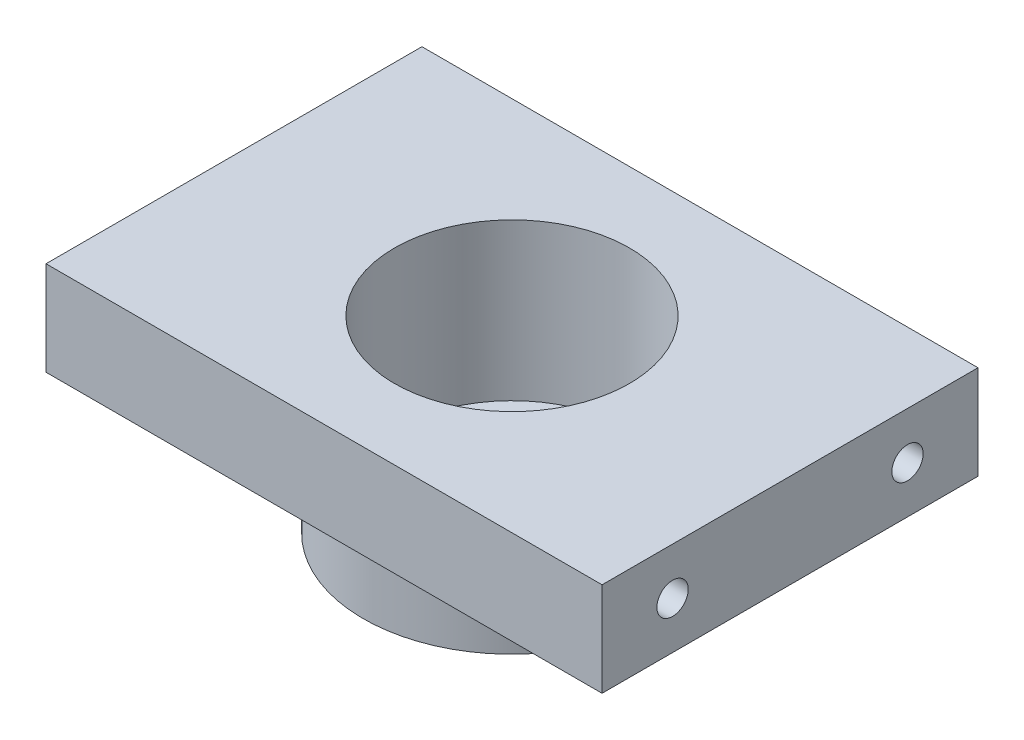
ISO-10303-21;
HEADER;
FILE_DESCRIPTION(('STEP AP214'),'2;1');
FILE_NAME('part.step','',(''),(''),'','','');
FILE_SCHEMA(('AUTOMOTIVE_DESIGN { 1 0 10303 214 1 1 1 1 }'));
ENDSEC;
DATA;
#1=APPLICATION_CONTEXT('core data for automotive mechanical design processes');
#2=APPLICATION_PROTOCOL_DEFINITION('international standard','automotive_design',2000,#1);
#3=PRODUCT_CONTEXT('',#1,'mechanical');
#4=PRODUCT('Part','Part','',(#3));
#5=PRODUCT_RELATED_PRODUCT_CATEGORY('part','',(#4));
#6=PRODUCT_DEFINITION_FORMATION('','',#4);
#7=PRODUCT_DEFINITION_CONTEXT('part definition',#1,'design');
#8=PRODUCT_DEFINITION('design','',#6,#7);
#9=PRODUCT_DEFINITION_SHAPE('','',#8);
#10=(LENGTH_UNIT() NAMED_UNIT(*) SI_UNIT(.MILLI.,.METRE.));
#11=(NAMED_UNIT(*) PLANE_ANGLE_UNIT() SI_UNIT($,.RADIAN.));
#12=(NAMED_UNIT(*) SI_UNIT($,.STERADIAN.) SOLID_ANGLE_UNIT());
#13=UNCERTAINTY_MEASURE_WITH_UNIT(LENGTH_MEASURE(1.E-05),#10,'distance_accuracy_value','');
#14=(GEOMETRIC_REPRESENTATION_CONTEXT(3) GLOBAL_UNCERTAINTY_ASSIGNED_CONTEXT((#13)) GLOBAL_UNIT_ASSIGNED_CONTEXT((#10,
#11,#12)) REPRESENTATION_CONTEXT('',''));
#15=CARTESIAN_POINT('',(0.,0.,0.));
#16=DIRECTION('',(0.,0.,1.));
#17=DIRECTION('',(1.,0.,0.));
#18=AXIS2_PLACEMENT_3D('',#15,#16,#17);
#19=CARTESIAN_POINT('',(59.,0.,0.));
#20=DIRECTION('',(0.,-1.,0.));
#21=DIRECTION('',(1.,0.,0.));
#22=AXIS2_PLACEMENT_3D('',#19,#20,#21);
#23=PLANE('',#22);
#24=CARTESIAN_POINT('',(0.,0.,0.));
#25=DIRECTION('',(0.,1.,0.));
#26=DIRECTION('',(-1.,0.,0.));
#27=AXIS2_PLACEMENT_3D('',#24,#25,#26);
#28=CIRCLE('',#27,15.);
#29=CARTESIAN_POINT('',(-15.,0.,0.));
#30=VERTEX_POINT('',#29);
#31=EDGE_CURVE('E123',#30,#30,#28,.T.);
#32=ORIENTED_EDGE('',*,*,#31,.F.);
#33=EDGE_LOOP('',(#32));
#34=FACE_BOUND('',#33,.T.);
#35=DIRECTION('',(1.,0.,0.));
#36=VECTOR('',#35,1.);
#37=CARTESIAN_POINT('',(35.5,0.,-24.));
#38=LINE('',#37,#36);
#39=CARTESIAN_POINT('',(-35.5000000000001,0.,-24.));
#40=VERTEX_POINT('',#39);
#41=CARTESIAN_POINT('',(35.5,0.,-24.));
#42=VERTEX_POINT('',#41);
#43=EDGE_CURVE('E48',#40,#42,#38,.T.);
#44=ORIENTED_EDGE('',*,*,#43,.F.);
#45=DIRECTION('',(0.,0.,-1.));
#46=VECTOR('',#45,1.);
#47=CARTESIAN_POINT('',(-35.5000000000001,0.,-24.));
#48=LINE('',#47,#46);
#49=CARTESIAN_POINT('',(-35.5000000000001,0.,24.));
#50=VERTEX_POINT('',#49);
#51=EDGE_CURVE('E78',#50,#40,#48,.T.);
#52=ORIENTED_EDGE('',*,*,#51,.F.);
#53=DIRECTION('',(-1.,0.,0.));
#54=VECTOR('',#53,1.);
#55=CARTESIAN_POINT('',(35.5,0.,24.));
#56=LINE('',#55,#54);
#57=CARTESIAN_POINT('',(35.5,0.,24.));
#58=VERTEX_POINT('',#57);
#59=EDGE_CURVE('E85',#58,#50,#56,.T.);
#60=ORIENTED_EDGE('',*,*,#59,.F.);
#61=DIRECTION('',(0.,0.,1.));
#62=VECTOR('',#61,1.);
#63=CARTESIAN_POINT('',(35.5,0.,-24.));
#64=LINE('',#63,#62);
#65=EDGE_CURVE('E90',#42,#58,#64,.T.);
#66=ORIENTED_EDGE('',*,*,#65,.F.);
#67=EDGE_LOOP('',(#44,#52,#60,#66));
#68=FACE_BOUND('',#67,.T.);
#69=ADVANCED_FACE('F32',(#34,#68),#23,.F.);
#70=CARTESIAN_POINT('',(19.,-12.,0.));
#71=DIRECTION('',(0.,1.,0.));
#72=DIRECTION('',(-1.,0.,0.));
#73=AXIS2_PLACEMENT_3D('',#70,#71,#72);
#74=PLANE('',#73);
#75=CARTESIAN_POINT('',(0.,-12.,0.));
#76=DIRECTION('',(0.,1.,0.));
#77=DIRECTION('',(-1.,0.,0.));
#78=AXIS2_PLACEMENT_3D('',#75,#76,#77);
#79=CIRCLE('',#78,19.);
#80=CARTESIAN_POINT('',(-19.,-12.,0.));
#81=VERTEX_POINT('',#80);
#82=EDGE_CURVE('E12',#81,#81,#79,.T.);
#83=ORIENTED_EDGE('',*,*,#82,.T.);
#84=EDGE_LOOP('',(#83));
#85=FACE_BOUND('',#84,.T.);
#86=DIRECTION('',(1.,0.,0.));
#87=VECTOR('',#86,1.);
#88=CARTESIAN_POINT('',(35.5,-12.,-24.));
#89=LINE('',#88,#87);
#90=CARTESIAN_POINT('',(-35.5000000000001,-12.,-24.));
#91=VERTEX_POINT('',#90);
#92=CARTESIAN_POINT('',(35.5,-12.,-24.));
#93=VERTEX_POINT('',#92);
#94=EDGE_CURVE('E97',#91,#93,#89,.T.);
#95=ORIENTED_EDGE('',*,*,#94,.T.);
#96=DIRECTION('',(0.,0.,1.));
#97=VECTOR('',#96,1.);
#98=CARTESIAN_POINT('',(35.5,-12.,-24.));
#99=LINE('',#98,#97);
#100=CARTESIAN_POINT('',(35.5,-12.,24.));
#101=VERTEX_POINT('',#100);
#102=EDGE_CURVE('E100',#93,#101,#99,.T.);
#103=ORIENTED_EDGE('',*,*,#102,.T.);
#104=DIRECTION('',(-1.,0.,0.));
#105=VECTOR('',#104,1.);
#106=CARTESIAN_POINT('',(35.5,-12.,24.));
#107=LINE('',#106,#105);
#108=CARTESIAN_POINT('',(-35.5000000000001,-12.,24.));
#109=VERTEX_POINT('',#108);
#110=EDGE_CURVE('E56',#101,#109,#107,.T.);
#111=ORIENTED_EDGE('',*,*,#110,.T.);
#112=DIRECTION('',(0.,0.,-1.));
#113=VECTOR('',#112,1.);
#114=CARTESIAN_POINT('',(-35.5000000000001,-12.,-24.));
#115=LINE('',#114,#113);
#116=EDGE_CURVE('E80',#109,#91,#115,.T.);
#117=ORIENTED_EDGE('',*,*,#116,.T.);
#118=EDGE_LOOP('',(#95,#103,#111,#117));
#119=FACE_BOUND('',#118,.T.);
#120=ADVANCED_FACE('F163',(#85,#119),#74,.F.);
#121=CARTESIAN_POINT('',(0.,0.,0.));
#122=DIRECTION('',(0.,1.,0.));
#123=DIRECTION('',(-1.,0.,0.));
#124=AXIS2_PLACEMENT_3D('',#121,#122,#123);
#125=CYLINDRICAL_SURFACE('',#124,19.);
#126=ORIENTED_EDGE('',*,*,#82,.F.);
#127=EDGE_LOOP('',(#126));
#128=FACE_BOUND('',#127,.T.);
#129=CARTESIAN_POINT('',(0.,-24.,0.));
#130=DIRECTION('',(0.,1.,0.));
#131=DIRECTION('',(-1.,0.,0.));
#132=AXIS2_PLACEMENT_3D('',#129,#130,#131);
#133=CIRCLE('',#132,19.);
#134=CARTESIAN_POINT('',(-19.,-24.,0.));
#135=VERTEX_POINT('',#134);
#136=EDGE_CURVE('E40',#135,#135,#133,.T.);
#137=ORIENTED_EDGE('',*,*,#136,.T.);
#138=EDGE_LOOP('',(#137));
#139=FACE_BOUND('',#138,.T.);
#140=ADVANCED_FACE('F168',(#128,#139),#125,.T.);
#141=CARTESIAN_POINT('',(9.,-24.,0.));
#142=DIRECTION('',(0.,1.,0.));
#143=DIRECTION('',(-1.,0.,0.));
#144=AXIS2_PLACEMENT_3D('',#141,#142,#143);
#145=PLANE('',#144);
#146=CARTESIAN_POINT('',(-12.9999999999998,-24.,-1.81557108488227E-13));
#147=DIRECTION('',(0.,-1.,0.));
#148=DIRECTION('',(1.,0.,0.));
#149=AXIS2_PLACEMENT_3D('',#146,#147,#148);
#150=CIRCLE('',#149,1.50000000000036);
#151=CARTESIAN_POINT('',(-11.4999999999995,-24.,-1.81557108488227E-13));
#152=VERTEX_POINT('',#151);
#153=EDGE_CURVE('E106',#152,#152,#150,.T.);
#154=ORIENTED_EDGE('',*,*,#153,.F.);
#155=EDGE_LOOP('',(#154));
#156=FACE_BOUND('',#155,.T.);
#157=CARTESIAN_POINT('',(2.7968506284591E-13,-24.,-12.9999999999999));
#158=DIRECTION('',(0.,-1.,0.));
#159=DIRECTION('',(1.,0.,0.));
#160=AXIS2_PLACEMENT_3D('',#157,#158,#159);
#161=CIRCLE('',#160,1.50000000000038);
#162=CARTESIAN_POINT('',(1.50000000000066,-24.,-12.9999999999999));
#163=VERTEX_POINT('',#162);
#164=EDGE_CURVE('E111',#163,#163,#161,.T.);
#165=ORIENTED_EDGE('',*,*,#164,.F.);
#166=EDGE_LOOP('',(#165));
#167=FACE_BOUND('',#166,.T.);
#168=CARTESIAN_POINT('',(13.,-24.,0.));
#169=DIRECTION('',(0.,-1.,0.));
#170=DIRECTION('',(1.,0.,0.));
#171=AXIS2_PLACEMENT_3D('',#168,#169,#170);
#172=CIRCLE('',#171,1.5);
#173=CARTESIAN_POINT('',(14.5,-24.,0.));
#174=VERTEX_POINT('',#173);
#175=EDGE_CURVE('E115',#174,#174,#172,.T.);
#176=ORIENTED_EDGE('',*,*,#175,.F.);
#177=EDGE_LOOP('',(#176));
#178=FACE_BOUND('',#177,.T.);
#179=CARTESIAN_POINT('',(0.,-24.,13.));
#180=DIRECTION('',(0.,-1.,0.));
#181=DIRECTION('',(1.,0.,0.));
#182=AXIS2_PLACEMENT_3D('',#179,#180,#181);
#183=CIRCLE('',#182,1.5);
#184=CARTESIAN_POINT('',(1.5,-24.,13.));
#185=VERTEX_POINT('',#184);
#186=EDGE_CURVE('E119',#185,#185,#183,.T.);
#187=ORIENTED_EDGE('',*,*,#186,.F.);
#188=EDGE_LOOP('',(#187));
#189=FACE_BOUND('',#188,.T.);
#190=ORIENTED_EDGE('',*,*,#136,.F.);
#191=EDGE_LOOP('',(#190));
#192=FACE_BOUND('',#191,.T.);
#193=CARTESIAN_POINT('',(0.,-24.,0.));
#194=DIRECTION('',(0.,1.,0.));
#195=DIRECTION('',(-1.,0.,0.));
#196=AXIS2_PLACEMENT_3D('',#193,#194,#195);
#197=CIRCLE('',#196,9.);
#198=CARTESIAN_POINT('',(-8.99999999999999,-24.,0.));
#199=VERTEX_POINT('',#198);
#200=EDGE_CURVE('E132',#199,#199,#197,.T.);
#201=ORIENTED_EDGE('',*,*,#200,.T.);
#202=EDGE_LOOP('',(#201));
#203=FACE_BOUND('',#202,.T.);
#204=ADVANCED_FACE('F189',(#156,#167,#178,#189,#192,#203),#145,.F.);
#205=CARTESIAN_POINT('',(0.,0.,0.));
#206=DIRECTION('',(0.,1.,0.));
#207=DIRECTION('',(-1.,0.,0.));
#208=AXIS2_PLACEMENT_3D('',#205,#206,#207);
#209=CYLINDRICAL_SURFACE('',#208,9.);
#210=ORIENTED_EDGE('',*,*,#200,.F.);
#211=EDGE_LOOP('',(#210));
#212=FACE_BOUND('',#211,.T.);
#213=CARTESIAN_POINT('',(0.,-20.,0.));
#214=DIRECTION('',(0.,1.,0.));
#215=DIRECTION('',(-1.,0.,0.));
#216=AXIS2_PLACEMENT_3D('',#213,#214,#215);
#217=CIRCLE('',#216,9.);
#218=CARTESIAN_POINT('',(-9.,-20.,0.));
#219=VERTEX_POINT('',#218);
#220=EDGE_CURVE('E129',#219,#219,#217,.T.);
#221=ORIENTED_EDGE('',*,*,#220,.T.);
#222=EDGE_LOOP('',(#221));
#223=FACE_BOUND('',#222,.T.);
#224=ADVANCED_FACE('F182',(#212,#223),#209,.F.);
#225=CARTESIAN_POINT('',(15.,-20.,0.));
#226=DIRECTION('',(0.,-1.,0.));
#227=DIRECTION('',(1.,0.,0.));
#228=AXIS2_PLACEMENT_3D('',#225,#226,#227);
#229=PLANE('',#228);
#230=CARTESIAN_POINT('',(-12.9999999999998,-20.,-1.81557108488227E-13));
#231=DIRECTION('',(0.,-1.,0.));
#232=DIRECTION('',(1.,0.,0.));
#233=AXIS2_PLACEMENT_3D('',#230,#231,#232);
#234=CIRCLE('',#233,1.50000000000036);
#235=CARTESIAN_POINT('',(-11.4999999999995,-20.,-1.81557108488227E-13));
#236=VERTEX_POINT('',#235);
#237=EDGE_CURVE('E35',#236,#236,#234,.T.);
#238=ORIENTED_EDGE('',*,*,#237,.T.);
#239=EDGE_LOOP('',(#238));
#240=FACE_BOUND('',#239,.T.);
#241=CARTESIAN_POINT('',(2.79195204126251E-13,-20.,-12.9999999999999));
#242=DIRECTION('',(0.,-1.,0.));
#243=DIRECTION('',(1.,0.,0.));
#244=AXIS2_PLACEMENT_3D('',#241,#242,#243);
#245=CIRCLE('',#244,1.50000000000038);
#246=CARTESIAN_POINT('',(1.50000000000066,-20.,-12.9999999999999));
#247=VERTEX_POINT('',#246);
#248=EDGE_CURVE('E114',#247,#247,#245,.T.);
#249=ORIENTED_EDGE('',*,*,#248,.T.);
#250=EDGE_LOOP('',(#249));
#251=FACE_BOUND('',#250,.T.);
#252=CARTESIAN_POINT('',(13.,-20.,0.));
#253=DIRECTION('',(0.,-1.,0.));
#254=DIRECTION('',(1.,0.,0.));
#255=AXIS2_PLACEMENT_3D('',#252,#253,#254);
#256=CIRCLE('',#255,1.5);
#257=CARTESIAN_POINT('',(14.5,-20.,0.));
#258=VERTEX_POINT('',#257);
#259=EDGE_CURVE('E118',#258,#258,#256,.T.);
#260=ORIENTED_EDGE('',*,*,#259,.T.);
#261=EDGE_LOOP('',(#260));
#262=FACE_BOUND('',#261,.T.);
#263=CARTESIAN_POINT('',(0.,-20.,13.));
#264=DIRECTION('',(0.,-1.,0.));
#265=DIRECTION('',(1.,0.,0.));
#266=AXIS2_PLACEMENT_3D('',#263,#264,#265);
#267=CIRCLE('',#266,1.5);
#268=CARTESIAN_POINT('',(1.5,-20.,13.));
#269=VERTEX_POINT('',#268);
#270=EDGE_CURVE('E122',#269,#269,#267,.T.);
#271=ORIENTED_EDGE('',*,*,#270,.T.);
#272=EDGE_LOOP('',(#271));
#273=FACE_BOUND('',#272,.T.);
#274=ORIENTED_EDGE('',*,*,#220,.F.);
#275=EDGE_LOOP('',(#274));
#276=FACE_BOUND('',#275,.T.);
#277=CARTESIAN_POINT('',(0.,-20.,0.));
#278=DIRECTION('',(0.,1.,0.));
#279=DIRECTION('',(-1.,0.,0.));
#280=AXIS2_PLACEMENT_3D('',#277,#278,#279);
#281=CIRCLE('',#280,15.);
#282=CARTESIAN_POINT('',(-15.,-20.,0.));
#283=VERTEX_POINT('',#282);
#284=EDGE_CURVE('E126',#283,#283,#281,.T.);
#285=ORIENTED_EDGE('',*,*,#284,.T.);
#286=EDGE_LOOP('',(#285));
#287=FACE_BOUND('',#286,.T.);
#288=ADVANCED_FACE('F143',(#240,#251,#262,#273,#276,#287),#229,.F.);
#289=CARTESIAN_POINT('',(0.,0.,0.));
#290=DIRECTION('',(0.,1.,0.));
#291=DIRECTION('',(-1.,0.,0.));
#292=AXIS2_PLACEMENT_3D('',#289,#290,#291);
#293=CYLINDRICAL_SURFACE('',#292,15.);
#294=ORIENTED_EDGE('',*,*,#284,.F.);
#295=EDGE_LOOP('',(#294));
#296=FACE_BOUND('',#295,.T.);
#297=ORIENTED_EDGE('',*,*,#31,.T.);
#298=EDGE_LOOP('',(#297));
#299=FACE_BOUND('',#298,.T.);
#300=ADVANCED_FACE('F172',(#296,#299),#293,.F.);
#301=CARTESIAN_POINT('',(0.,0.,13.));
#302=DIRECTION('',(0.,-1.,0.));
#303=DIRECTION('',(1.,0.,0.));
#304=AXIS2_PLACEMENT_3D('',#301,#302,#303);
#305=CYLINDRICAL_SURFACE('',#304,1.5);
#306=ORIENTED_EDGE('',*,*,#186,.T.);
#307=EDGE_LOOP('',(#306));
#308=FACE_BOUND('',#307,.T.);
#309=ORIENTED_EDGE('',*,*,#270,.F.);
#310=EDGE_LOOP('',(#309));
#311=FACE_BOUND('',#310,.T.);
#312=ADVANCED_FACE('F159',(#308,#311),#305,.F.);
#313=CARTESIAN_POINT('',(13.,0.,0.));
#314=DIRECTION('',(0.,-1.,0.));
#315=DIRECTION('',(1.,0.,0.));
#316=AXIS2_PLACEMENT_3D('',#313,#314,#315);
#317=CYLINDRICAL_SURFACE('',#316,1.5);
#318=ORIENTED_EDGE('',*,*,#175,.T.);
#319=EDGE_LOOP('',(#318));
#320=FACE_BOUND('',#319,.T.);
#321=ORIENTED_EDGE('',*,*,#259,.F.);
#322=EDGE_LOOP('',(#321));
#323=FACE_BOUND('',#322,.T.);
#324=ADVANCED_FACE('F149',(#320,#323),#317,.F.);
#325=CARTESIAN_POINT('',(2.76745910527956E-13,0.,-12.9999999999999));
#326=DIRECTION('',(0.,-1.,0.));
#327=DIRECTION('',(1.,0.,0.));
#328=AXIS2_PLACEMENT_3D('',#325,#326,#327);
#329=CYLINDRICAL_SURFACE('',#328,1.50000000000038);
#330=ORIENTED_EDGE('',*,*,#164,.T.);
#331=EDGE_LOOP('',(#330));
#332=FACE_BOUND('',#331,.T.);
#333=ORIENTED_EDGE('',*,*,#248,.F.);
#334=EDGE_LOOP('',(#333));
#335=FACE_BOUND('',#334,.T.);
#336=ADVANCED_FACE('F146',(#332,#335),#329,.F.);
#337=CARTESIAN_POINT('',(-12.9999999999998,0.,-1.81557108488227E-13));
#338=DIRECTION('',(0.,-1.,0.));
#339=DIRECTION('',(1.,0.,0.));
#340=AXIS2_PLACEMENT_3D('',#337,#338,#339);
#341=CYLINDRICAL_SURFACE('',#340,1.50000000000036);
#342=ORIENTED_EDGE('',*,*,#153,.T.);
#343=EDGE_LOOP('',(#342));
#344=FACE_BOUND('',#343,.T.);
#345=ORIENTED_EDGE('',*,*,#237,.F.);
#346=EDGE_LOOP('',(#345));
#347=FACE_BOUND('',#346,.T.);
#348=ADVANCED_FACE('F148',(#344,#347),#341,.F.);
#349=CARTESIAN_POINT('',(35.5,0.,-24.));
#350=DIRECTION('',(0.,0.,-1.));
#351=DIRECTION('',(-1.,0.,0.));
#352=AXIS2_PLACEMENT_3D('',#349,#350,#351);
#353=PLANE('',#352);
#354=ORIENTED_EDGE('',*,*,#94,.F.);
#355=DIRECTION('',(0.,-1.,0.));
#356=VECTOR('',#355,1.);
#357=CARTESIAN_POINT('',(-35.5000000000001,0.,-24.));
#358=LINE('',#357,#356);
#359=EDGE_CURVE('E81',#40,#91,#358,.T.);
#360=ORIENTED_EDGE('',*,*,#359,.F.);
#361=ORIENTED_EDGE('',*,*,#43,.T.);
#362=DIRECTION('',(0.,-1.,0.));
#363=VECTOR('',#362,1.);
#364=CARTESIAN_POINT('',(35.5,0.,-24.));
#365=LINE('',#364,#363);
#366=EDGE_CURVE('E92',#42,#93,#365,.T.);
#367=ORIENTED_EDGE('',*,*,#366,.T.);
#368=EDGE_LOOP('',(#354,#360,#361,#367));
#369=FACE_BOUND('',#368,.T.);
#370=ADVANCED_FACE('F156',(#369),#353,.T.);
#371=CARTESIAN_POINT('',(-35.5000000000001,0.,-24.));
#372=DIRECTION('',(-1.,0.,0.));
#373=DIRECTION('',(0.,0.,1.));
#374=AXIS2_PLACEMENT_3D('',#371,#372,#373);
#375=PLANE('',#374);
#376=CARTESIAN_POINT('',(-35.5000000000001,-6.00000000000001,-15.));
#377=DIRECTION('',(-1.,0.,0.));
#378=DIRECTION('',(0.,0.,-1.));
#379=AXIS2_PLACEMENT_3D('',#376,#377,#378);
#380=CIRCLE('',#379,2.);
#381=CARTESIAN_POINT('',(-35.5000000000001,-6.00000000000001,-17.));
#382=VERTEX_POINT('',#381);
#383=EDGE_CURVE('E233',#382,#382,#380,.T.);
#384=ORIENTED_EDGE('',*,*,#383,.F.);
#385=EDGE_LOOP('',(#384));
#386=FACE_BOUND('',#385,.T.);
#387=CARTESIAN_POINT('',(-35.5000000000001,-6.00000000000001,15.));
#388=DIRECTION('',(-1.,0.,0.));
#389=DIRECTION('',(0.,0.,1.));
#390=AXIS2_PLACEMENT_3D('',#387,#388,#389);
#391=CIRCLE('',#390,2.);
#392=CARTESIAN_POINT('',(-35.5000000000001,-6.00000000000001,17.));
#393=VERTEX_POINT('',#392);
#394=EDGE_CURVE('E227',#393,#393,#391,.T.);
#395=ORIENTED_EDGE('',*,*,#394,.F.);
#396=EDGE_LOOP('',(#395));
#397=FACE_BOUND('',#396,.T.);
#398=ORIENTED_EDGE('',*,*,#116,.F.);
#399=DIRECTION('',(0.,-1.,0.));
#400=VECTOR('',#399,1.);
#401=CARTESIAN_POINT('',(-35.5000000000001,0.,24.));
#402=LINE('',#401,#400);
#403=EDGE_CURVE('E74',#50,#109,#402,.T.);
#404=ORIENTED_EDGE('',*,*,#403,.F.);
#405=ORIENTED_EDGE('',*,*,#51,.T.);
#406=ORIENTED_EDGE('',*,*,#359,.T.);
#407=EDGE_LOOP('',(#398,#404,#405,#406));
#408=FACE_BOUND('',#407,.T.);
#409=ADVANCED_FACE('F76',(#386,#397,#408),#375,.T.);
#410=CARTESIAN_POINT('',(35.5,0.,24.));
#411=DIRECTION('',(0.,0.,1.));
#412=DIRECTION('',(1.,0.,0.));
#413=AXIS2_PLACEMENT_3D('',#410,#411,#412);
#414=PLANE('',#413);
#415=ORIENTED_EDGE('',*,*,#110,.F.);
#416=DIRECTION('',(0.,-1.,0.));
#417=VECTOR('',#416,1.);
#418=CARTESIAN_POINT('',(35.5,0.,24.));
#419=LINE('',#418,#417);
#420=EDGE_CURVE('E82',#58,#101,#419,.T.);
#421=ORIENTED_EDGE('',*,*,#420,.F.);
#422=ORIENTED_EDGE('',*,*,#59,.T.);
#423=ORIENTED_EDGE('',*,*,#403,.T.);
#424=EDGE_LOOP('',(#415,#421,#422,#423));
#425=FACE_BOUND('',#424,.T.);
#426=ADVANCED_FACE('F86',(#425),#414,.T.);
#427=CARTESIAN_POINT('',(35.5,0.,-24.));
#428=DIRECTION('',(1.,0.,0.));
#429=DIRECTION('',(0.,0.,-1.));
#430=AXIS2_PLACEMENT_3D('',#427,#428,#429);
#431=PLANE('',#430);
#432=CARTESIAN_POINT('',(35.5,-6.,-15.));
#433=DIRECTION('',(1.,0.,0.));
#434=DIRECTION('',(0.,0.,1.));
#435=AXIS2_PLACEMENT_3D('',#432,#433,#434);
#436=CIRCLE('',#435,2.);
#437=CARTESIAN_POINT('',(35.5,-6.,-13.));
#438=VERTEX_POINT('',#437);
#439=EDGE_CURVE('E221',#438,#438,#436,.T.);
#440=ORIENTED_EDGE('',*,*,#439,.F.);
#441=EDGE_LOOP('',(#440));
#442=FACE_BOUND('',#441,.T.);
#443=CARTESIAN_POINT('',(35.5,-6.,15.));
#444=DIRECTION('',(1.,0.,0.));
#445=DIRECTION('',(0.,0.,-1.));
#446=AXIS2_PLACEMENT_3D('',#443,#444,#445);
#447=CIRCLE('',#446,2.);
#448=CARTESIAN_POINT('',(35.5,-6.,13.));
#449=VERTEX_POINT('',#448);
#450=EDGE_CURVE('E215',#449,#449,#447,.T.);
#451=ORIENTED_EDGE('',*,*,#450,.F.);
#452=EDGE_LOOP('',(#451));
#453=FACE_BOUND('',#452,.T.);
#454=ORIENTED_EDGE('',*,*,#102,.F.);
#455=ORIENTED_EDGE('',*,*,#366,.F.);
#456=ORIENTED_EDGE('',*,*,#65,.T.);
#457=ORIENTED_EDGE('',*,*,#420,.T.);
#458=EDGE_LOOP('',(#454,#455,#456,#457));
#459=FACE_BOUND('',#458,.T.);
#460=ADVANCED_FACE('F212',(#442,#453,#459),#431,.T.);
#461=CARTESIAN_POINT('',(25.5,-6.,15.));
#462=DIRECTION('',(1.,0.,0.));
#463=DIRECTION('',(0.,0.,-1.));
#464=AXIS2_PLACEMENT_3D('',#461,#462,#463);
#465=CYLINDRICAL_SURFACE('',#464,2.);
#466=CARTESIAN_POINT('',(25.5,-6.,15.));
#467=DIRECTION('',(1.,0.,0.));
#468=DIRECTION('',(0.,0.,-1.));
#469=AXIS2_PLACEMENT_3D('',#466,#467,#468);
#470=CIRCLE('',#469,2.);
#471=CARTESIAN_POINT('',(25.5,-6.,13.));
#472=VERTEX_POINT('',#471);
#473=EDGE_CURVE('E101',#472,#472,#470,.T.);
#474=ORIENTED_EDGE('',*,*,#473,.F.);
#475=EDGE_LOOP('',(#474));
#476=FACE_BOUND('',#475,.T.);
#477=ORIENTED_EDGE('',*,*,#450,.T.);
#478=EDGE_LOOP('',(#477));
#479=FACE_BOUND('',#478,.T.);
#480=ADVANCED_FACE('F275',(#476,#479),#465,.F.);
#481=CARTESIAN_POINT('',(25.5,-6.,15.));
#482=DIRECTION('',(1.,0.,0.));
#483=DIRECTION('',(0.,0.,-1.));
#484=AXIS2_PLACEMENT_3D('',#481,#482,#483);
#485=PLANE('',#484);
#486=ORIENTED_EDGE('',*,*,#473,.T.);
#487=EDGE_LOOP('',(#486));
#488=FACE_BOUND('',#487,.T.);
#489=ADVANCED_FACE('F271',(#488),#485,.T.);
#490=CARTESIAN_POINT('',(25.5,-6.,-15.));
#491=DIRECTION('',(1.,0.,0.));
#492=DIRECTION('',(0.,0.,-1.));
#493=AXIS2_PLACEMENT_3D('',#490,#491,#492);
#494=CYLINDRICAL_SURFACE('',#493,2.);
#495=CARTESIAN_POINT('',(25.5,-6.,-15.));
#496=DIRECTION('',(1.,0.,0.));
#497=DIRECTION('',(0.,0.,1.));
#498=AXIS2_PLACEMENT_3D('',#495,#496,#497);
#499=CIRCLE('',#498,2.);
#500=CARTESIAN_POINT('',(25.5,-6.,-13.));
#501=VERTEX_POINT('',#500);
#502=EDGE_CURVE('E218',#501,#501,#499,.T.);
#503=ORIENTED_EDGE('',*,*,#502,.F.);
#504=EDGE_LOOP('',(#503));
#505=FACE_BOUND('',#504,.T.);
#506=ORIENTED_EDGE('',*,*,#439,.T.);
#507=EDGE_LOOP('',(#506));
#508=FACE_BOUND('',#507,.T.);
#509=ADVANCED_FACE('F264',(#505,#508),#494,.F.);
#510=CARTESIAN_POINT('',(25.5,-6.,-15.));
#511=DIRECTION('',(-1.,0.,0.));
#512=DIRECTION('',(0.,0.,1.));
#513=AXIS2_PLACEMENT_3D('',#510,#511,#512);
#514=PLANE('',#513);
#515=ORIENTED_EDGE('',*,*,#502,.T.);
#516=EDGE_LOOP('',(#515));
#517=FACE_BOUND('',#516,.T.);
#518=ADVANCED_FACE('F255',(#517),#514,.F.);
#519=CARTESIAN_POINT('',(-25.5000000000001,-6.00000000000001,15.));
#520=DIRECTION('',(-1.,0.,0.));
#521=DIRECTION('',(0.,0.,1.));
#522=AXIS2_PLACEMENT_3D('',#519,#520,#521);
#523=CYLINDRICAL_SURFACE('',#522,2.);
#524=CARTESIAN_POINT('',(-25.5000000000001,-6.00000000000001,15.));
#525=DIRECTION('',(-1.,0.,0.));
#526=DIRECTION('',(0.,0.,1.));
#527=AXIS2_PLACEMENT_3D('',#524,#525,#526);
#528=CIRCLE('',#527,2.);
#529=CARTESIAN_POINT('',(-25.5000000000001,-6.00000000000001,17.));
#530=VERTEX_POINT('',#529);
#531=EDGE_CURVE('E224',#530,#530,#528,.T.);
#532=ORIENTED_EDGE('',*,*,#531,.F.);
#533=EDGE_LOOP('',(#532));
#534=FACE_BOUND('',#533,.T.);
#535=ORIENTED_EDGE('',*,*,#394,.T.);
#536=EDGE_LOOP('',(#535));
#537=FACE_BOUND('',#536,.T.);
#538=ADVANCED_FACE('F253',(#534,#537),#523,.F.);
#539=CARTESIAN_POINT('',(-25.5000000000001,-6.00000000000001,15.));
#540=DIRECTION('',(-1.,0.,0.));
#541=DIRECTION('',(0.,0.,1.));
#542=AXIS2_PLACEMENT_3D('',#539,#540,#541);
#543=PLANE('',#542);
#544=ORIENTED_EDGE('',*,*,#531,.T.);
#545=EDGE_LOOP('',(#544));
#546=FACE_BOUND('',#545,.T.);
#547=ADVANCED_FACE('F244',(#546),#543,.T.);
#548=CARTESIAN_POINT('',(-25.5000000000001,-6.00000000000001,-15.));
#549=DIRECTION('',(-1.,0.,0.));
#550=DIRECTION('',(0.,0.,1.));
#551=AXIS2_PLACEMENT_3D('',#548,#549,#550);
#552=CYLINDRICAL_SURFACE('',#551,2.);
#553=CARTESIAN_POINT('',(-25.5000000000001,-6.00000000000001,-15.));
#554=DIRECTION('',(-1.,0.,0.));
#555=DIRECTION('',(0.,0.,-1.));
#556=AXIS2_PLACEMENT_3D('',#553,#554,#555);
#557=CIRCLE('',#556,2.);
#558=CARTESIAN_POINT('',(-25.5000000000001,-6.00000000000001,-17.));
#559=VERTEX_POINT('',#558);
#560=EDGE_CURVE('E230',#559,#559,#557,.T.);
#561=ORIENTED_EDGE('',*,*,#560,.F.);
#562=EDGE_LOOP('',(#561));
#563=FACE_BOUND('',#562,.T.);
#564=ORIENTED_EDGE('',*,*,#383,.T.);
#565=EDGE_LOOP('',(#564));
#566=FACE_BOUND('',#565,.T.);
#567=ADVANCED_FACE('F241',(#563,#566),#552,.F.);
#568=CARTESIAN_POINT('',(-25.5000000000001,-6.00000000000001,-15.));
#569=DIRECTION('',(1.,0.,0.));
#570=DIRECTION('',(0.,0.,-1.));
#571=AXIS2_PLACEMENT_3D('',#568,#569,#570);
#572=PLANE('',#571);
#573=ORIENTED_EDGE('',*,*,#560,.T.);
#574=EDGE_LOOP('',(#573));
#575=FACE_BOUND('',#574,.T.);
#576=ADVANCED_FACE('F239',(#575),#572,.F.);
#577=CLOSED_SHELL('',(#69,#120,#140,#204,#224,#288,#300,#312,#324,#336,#348,#370,#409,#426,#460,
#480,#489,#509,#518,#538,#547,#567,#576));
#578=MANIFOLD_SOLID_BREP('B2',#577);
#579=ADVANCED_BREP_SHAPE_REPRESENTATION('',(#18,#578),#14);
#580=SHAPE_DEFINITION_REPRESENTATION(#9,#579);
ENDSEC;
END-ISO-10303-21;
